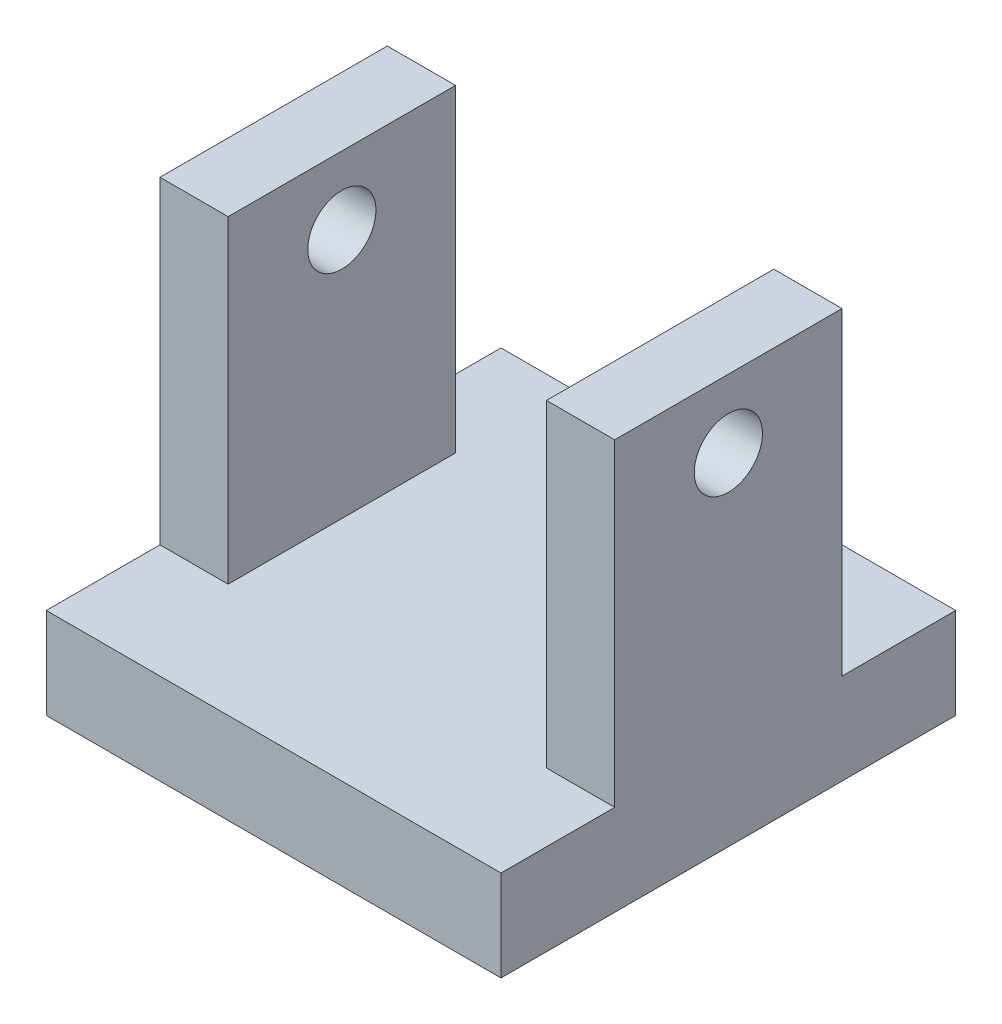
ISO-10303-21;
HEADER;
FILE_DESCRIPTION(('STEP AP214'),'2;1');
FILE_NAME('part.step','',(''),(''),'','','');
FILE_SCHEMA(('AUTOMOTIVE_DESIGN { 1 0 10303 214 1 1 1 1 }'));
ENDSEC;
DATA;
#1=APPLICATION_CONTEXT('core data for automotive mechanical design processes');
#2=APPLICATION_PROTOCOL_DEFINITION('international standard','automotive_design',2000,#1);
#3=PRODUCT_CONTEXT('',#1,'mechanical');
#4=PRODUCT('Part','Part','',(#3));
#5=PRODUCT_RELATED_PRODUCT_CATEGORY('part','',(#4));
#6=PRODUCT_DEFINITION_FORMATION('','',#4);
#7=PRODUCT_DEFINITION_CONTEXT('part definition',#1,'design');
#8=PRODUCT_DEFINITION('design','',#6,#7);
#9=PRODUCT_DEFINITION_SHAPE('','',#8);
#10=(LENGTH_UNIT() NAMED_UNIT(*) SI_UNIT(.MILLI.,.METRE.));
#11=(NAMED_UNIT(*) PLANE_ANGLE_UNIT() SI_UNIT($,.RADIAN.));
#12=(NAMED_UNIT(*) SI_UNIT($,.STERADIAN.) SOLID_ANGLE_UNIT());
#13=UNCERTAINTY_MEASURE_WITH_UNIT(LENGTH_MEASURE(1.E-05),#10,'distance_accuracy_value','');
#14=(GEOMETRIC_REPRESENTATION_CONTEXT(3) GLOBAL_UNCERTAINTY_ASSIGNED_CONTEXT((#13)) GLOBAL_UNIT_ASSIGNED_CONTEXT((#10,
#11,#12)) REPRESENTATION_CONTEXT('',''));
#15=CARTESIAN_POINT('',(0.,0.,0.));
#16=DIRECTION('',(0.,0.,1.));
#17=DIRECTION('',(1.,0.,0.));
#18=AXIS2_PLACEMENT_3D('',#15,#16,#17);
#19=CARTESIAN_POINT('',(0.,10.,0.));
#20=DIRECTION('',(0.,-1.,0.));
#21=DIRECTION('',(0.,0.,-1.));
#22=AXIS2_PLACEMENT_3D('',#19,#20,#21);
#23=PLANE('',#22);
#24=DIRECTION('',(-1.,0.,0.));
#25=VECTOR('',#24,1.);
#26=CARTESIAN_POINT('',(50.,10.,-37.5));
#27=LINE('',#26,#25);
#28=CARTESIAN_POINT('',(50.,10.,-37.5));
#29=VERTEX_POINT('',#28);
#30=CARTESIAN_POINT('',(42.5,10.,-37.5));
#31=VERTEX_POINT('',#30);
#32=EDGE_CURVE('E389',#29,#31,#27,.T.);
#33=ORIENTED_EDGE('',*,*,#32,.F.);
#34=DIRECTION('',(0.,0.,-1.));
#35=VECTOR('',#34,1.);
#36=CARTESIAN_POINT('',(50.,10.,0.));
#37=LINE('',#36,#35);
#38=CARTESIAN_POINT('',(50.,10.,-50.));
#39=VERTEX_POINT('',#38);
#40=EDGE_CURVE('E146',#29,#39,#37,.T.);
#41=ORIENTED_EDGE('',*,*,#40,.T.);
#42=DIRECTION('',(-1.,0.,0.));
#43=VECTOR('',#42,1.);
#44=CARTESIAN_POINT('',(0.,10.,-50.));
#45=LINE('',#44,#43);
#46=CARTESIAN_POINT('',(0.,10.,-50.));
#47=VERTEX_POINT('',#46);
#48=EDGE_CURVE('E190',#39,#47,#45,.T.);
#49=ORIENTED_EDGE('',*,*,#48,.T.);
#50=DIRECTION('',(0.,0.,1.));
#51=VECTOR('',#50,1.);
#52=CARTESIAN_POINT('',(0.,10.,0.));
#53=LINE('',#52,#51);
#54=CARTESIAN_POINT('',(0.,10.,-37.5));
#55=VERTEX_POINT('',#54);
#56=EDGE_CURVE('E183',#47,#55,#53,.T.);
#57=ORIENTED_EDGE('',*,*,#56,.T.);
#58=DIRECTION('',(-1.,0.,0.));
#59=VECTOR('',#58,1.);
#60=CARTESIAN_POINT('',(0.,10.,-37.5));
#61=LINE('',#60,#59);
#62=CARTESIAN_POINT('',(7.5,10.,-37.5));
#63=VERTEX_POINT('',#62);
#64=EDGE_CURVE('E160',#63,#55,#61,.T.);
#65=ORIENTED_EDGE('',*,*,#64,.F.);
#66=DIRECTION('',(0.,0.,-1.));
#67=VECTOR('',#66,1.);
#68=CARTESIAN_POINT('',(7.5,10.,-37.5));
#69=LINE('',#68,#67);
#70=CARTESIAN_POINT('',(7.5,10.,-12.5));
#71=VERTEX_POINT('',#70);
#72=EDGE_CURVE('E150',#71,#63,#69,.T.);
#73=ORIENTED_EDGE('',*,*,#72,.F.);
#74=DIRECTION('',(1.,0.,0.));
#75=VECTOR('',#74,1.);
#76=CARTESIAN_POINT('',(0.,10.,-12.5));
#77=LINE('',#76,#75);
#78=CARTESIAN_POINT('',(0.,10.,-12.5));
#79=VERTEX_POINT('',#78);
#80=EDGE_CURVE('E147',#79,#71,#77,.T.);
#81=ORIENTED_EDGE('',*,*,#80,.F.);
#82=CARTESIAN_POINT('',(0.,10.,0.));
#83=VERTEX_POINT('',#82);
#84=EDGE_CURVE('E186',#79,#83,#53,.T.);
#85=ORIENTED_EDGE('',*,*,#84,.T.);
#86=DIRECTION('',(1.,0.,0.));
#87=VECTOR('',#86,1.);
#88=CARTESIAN_POINT('',(0.,10.,0.));
#89=LINE('',#88,#87);
#90=CARTESIAN_POINT('',(50.,10.,0.));
#91=VERTEX_POINT('',#90);
#92=EDGE_CURVE('E185',#83,#91,#89,.T.);
#93=ORIENTED_EDGE('',*,*,#92,.T.);
#94=CARTESIAN_POINT('',(50.,10.,-12.5));
#95=VERTEX_POINT('',#94);
#96=EDGE_CURVE('E188',#91,#95,#37,.T.);
#97=ORIENTED_EDGE('',*,*,#96,.T.);
#98=DIRECTION('',(1.,0.,0.));
#99=VECTOR('',#98,1.);
#100=CARTESIAN_POINT('',(50.,10.,-12.5));
#101=LINE('',#100,#99);
#102=CARTESIAN_POINT('',(42.5,10.,-12.5));
#103=VERTEX_POINT('',#102);
#104=EDGE_CURVE('E56',#103,#95,#101,.T.);
#105=ORIENTED_EDGE('',*,*,#104,.F.);
#106=DIRECTION('',(0.,0.,1.));
#107=VECTOR('',#106,1.);
#108=CARTESIAN_POINT('',(42.5,10.,-37.5));
#109=LINE('',#108,#107);
#110=EDGE_CURVE('E51',#31,#103,#109,.T.);
#111=ORIENTED_EDGE('',*,*,#110,.F.);
#112=EDGE_LOOP('',(#33,#41,#49,#57,#65,#73,#81,#85,#93,#97,#105,#111));
#113=FACE_BOUND('',#112,.T.);
#114=ADVANCED_FACE('F35',(#113),#23,.F.);
#115=CARTESIAN_POINT('',(0.,10.,0.));
#116=DIRECTION('',(1.,0.,0.));
#117=DIRECTION('',(0.,0.,-1.));
#118=AXIS2_PLACEMENT_3D('',#115,#116,#117);
#119=PLANE('',#118);
#120=CARTESIAN_POINT('',(0.,37.5,-25.));
#121=DIRECTION('',(1.,0.,0.));
#122=DIRECTION('',(0.,0.,-1.));
#123=AXIS2_PLACEMENT_3D('',#120,#121,#122);
#124=CIRCLE('',#123,3.75);
#125=CARTESIAN_POINT('',(0.,37.5,-28.75));
#126=VERTEX_POINT('',#125);
#127=EDGE_CURVE('E385',#126,#126,#124,.F.);
#128=ORIENTED_EDGE('',*,*,#127,.F.);
#129=EDGE_LOOP('',(#128));
#130=FACE_BOUND('',#129,.T.);
#131=DIRECTION('',(0.,0.,1.));
#132=VECTOR('',#131,1.);
#133=CARTESIAN_POINT('',(0.,0.,0.));
#134=LINE('',#133,#132);
#135=CARTESIAN_POINT('',(0.,0.,-50.));
#136=VERTEX_POINT('',#135);
#137=CARTESIAN_POINT('',(0.,0.,0.));
#138=VERTEX_POINT('',#137);
#139=EDGE_CURVE('E182',#136,#138,#134,.T.);
#140=ORIENTED_EDGE('',*,*,#139,.T.);
#141=DIRECTION('',(0.,-1.,0.));
#142=VECTOR('',#141,1.);
#143=CARTESIAN_POINT('',(0.,10.,0.));
#144=LINE('',#143,#142);
#145=EDGE_CURVE('E11',#83,#138,#144,.T.);
#146=ORIENTED_EDGE('',*,*,#145,.F.);
#147=ORIENTED_EDGE('',*,*,#84,.F.);
#148=DIRECTION('',(0.,-1.,0.));
#149=VECTOR('',#148,1.);
#150=CARTESIAN_POINT('',(0.,45.,-12.5));
#151=LINE('',#150,#149);
#152=CARTESIAN_POINT('',(0.,45.,-12.5));
#153=VERTEX_POINT('',#152);
#154=EDGE_CURVE('E179',#153,#79,#151,.T.);
#155=ORIENTED_EDGE('',*,*,#154,.F.);
#156=DIRECTION('',(0.,0.,1.));
#157=VECTOR('',#156,1.);
#158=CARTESIAN_POINT('',(0.,45.,-37.5));
#159=LINE('',#158,#157);
#160=CARTESIAN_POINT('',(0.,45.,-37.5));
#161=VERTEX_POINT('',#160);
#162=EDGE_CURVE('E156',#161,#153,#159,.T.);
#163=ORIENTED_EDGE('',*,*,#162,.F.);
#164=DIRECTION('',(0.,-1.,0.));
#165=VECTOR('',#164,1.);
#166=CARTESIAN_POINT('',(0.,45.,-37.5));
#167=LINE('',#166,#165);
#168=EDGE_CURVE('E165',#161,#55,#167,.T.);
#169=ORIENTED_EDGE('',*,*,#168,.T.);
#170=ORIENTED_EDGE('',*,*,#56,.F.);
#171=DIRECTION('',(0.,-1.,0.));
#172=VECTOR('',#171,1.);
#173=CARTESIAN_POINT('',(0.,10.,-50.));
#174=LINE('',#173,#172);
#175=EDGE_CURVE('E192',#47,#136,#174,.T.);
#176=ORIENTED_EDGE('',*,*,#175,.T.);
#177=EDGE_LOOP('',(#140,#146,#147,#155,#163,#169,#170,#176));
#178=FACE_BOUND('',#177,.T.);
#179=ADVANCED_FACE('F37',(#130,#178),#119,.F.);
#180=CARTESIAN_POINT('',(0.,10.,0.));
#181=DIRECTION('',(0.,0.,-1.));
#182=DIRECTION('',(-1.,0.,0.));
#183=AXIS2_PLACEMENT_3D('',#180,#181,#182);
#184=PLANE('',#183);
#185=DIRECTION('',(1.,0.,0.));
#186=VECTOR('',#185,1.);
#187=CARTESIAN_POINT('',(0.,0.,0.));
#188=LINE('',#187,#186);
#189=CARTESIAN_POINT('',(50.,0.,0.));
#190=VERTEX_POINT('',#189);
#191=EDGE_CURVE('E195',#138,#190,#188,.T.);
#192=ORIENTED_EDGE('',*,*,#191,.T.);
#193=DIRECTION('',(0.,-1.,0.));
#194=VECTOR('',#193,1.);
#195=CARTESIAN_POINT('',(50.,10.,0.));
#196=LINE('',#195,#194);
#197=EDGE_CURVE('E44',#91,#190,#196,.T.);
#198=ORIENTED_EDGE('',*,*,#197,.F.);
#199=ORIENTED_EDGE('',*,*,#92,.F.);
#200=ORIENTED_EDGE('',*,*,#145,.T.);
#201=EDGE_LOOP('',(#192,#198,#199,#200));
#202=FACE_BOUND('',#201,.T.);
#203=ADVANCED_FACE('F237',(#202),#184,.F.);
#204=CARTESIAN_POINT('',(50.,10.,0.));
#205=DIRECTION('',(-1.,0.,0.));
#206=DIRECTION('',(0.,0.,1.));
#207=AXIS2_PLACEMENT_3D('',#204,#205,#206);
#208=PLANE('',#207);
#209=CARTESIAN_POINT('',(50.,37.5,-25.));
#210=DIRECTION('',(1.,0.,0.));
#211=DIRECTION('',(0.,0.,-1.));
#212=AXIS2_PLACEMENT_3D('',#209,#210,#211);
#213=CIRCLE('',#212,3.75);
#214=CARTESIAN_POINT('',(50.,37.5,-28.75));
#215=VERTEX_POINT('',#214);
#216=EDGE_CURVE('E404',#215,#215,#213,.T.);
#217=ORIENTED_EDGE('',*,*,#216,.F.);
#218=EDGE_LOOP('',(#217));
#219=FACE_BOUND('',#218,.T.);
#220=DIRECTION('',(0.,0.,-1.));
#221=VECTOR('',#220,1.);
#222=CARTESIAN_POINT('',(50.,0.,0.));
#223=LINE('',#222,#221);
#224=CARTESIAN_POINT('',(50.,0.,-50.));
#225=VERTEX_POINT('',#224);
#226=EDGE_CURVE('E197',#190,#225,#223,.T.);
#227=ORIENTED_EDGE('',*,*,#226,.T.);
#228=DIRECTION('',(0.,-1.,0.));
#229=VECTOR('',#228,1.);
#230=CARTESIAN_POINT('',(50.,10.,-50.));
#231=LINE('',#230,#229);
#232=EDGE_CURVE('E203',#39,#225,#231,.T.);
#233=ORIENTED_EDGE('',*,*,#232,.F.);
#234=ORIENTED_EDGE('',*,*,#40,.F.);
#235=DIRECTION('',(0.,-1.,0.));
#236=VECTOR('',#235,1.);
#237=CARTESIAN_POINT('',(50.,45.,-37.5));
#238=LINE('',#237,#236);
#239=CARTESIAN_POINT('',(50.,45.,-37.5));
#240=VERTEX_POINT('',#239);
#241=EDGE_CURVE('E128',#240,#29,#238,.T.);
#242=ORIENTED_EDGE('',*,*,#241,.F.);
#243=DIRECTION('',(0.,0.,-1.));
#244=VECTOR('',#243,1.);
#245=CARTESIAN_POINT('',(50.,45.,-37.5));
#246=LINE('',#245,#244);
#247=CARTESIAN_POINT('',(50.,45.,-12.5));
#248=VERTEX_POINT('',#247);
#249=EDGE_CURVE('E134',#248,#240,#246,.T.);
#250=ORIENTED_EDGE('',*,*,#249,.F.);
#251=DIRECTION('',(0.,-1.,0.));
#252=VECTOR('',#251,1.);
#253=CARTESIAN_POINT('',(50.,45.,-12.5));
#254=LINE('',#253,#252);
#255=EDGE_CURVE('E397',#248,#95,#254,.T.);
#256=ORIENTED_EDGE('',*,*,#255,.T.);
#257=ORIENTED_EDGE('',*,*,#96,.F.);
#258=ORIENTED_EDGE('',*,*,#197,.T.);
#259=EDGE_LOOP('',(#227,#233,#234,#242,#250,#256,#257,#258));
#260=FACE_BOUND('',#259,.T.);
#261=ADVANCED_FACE('F144',(#219,#260),#208,.F.);
#262=CARTESIAN_POINT('',(0.,10.,-50.));
#263=DIRECTION('',(0.,0.,1.));
#264=DIRECTION('',(1.,0.,0.));
#265=AXIS2_PLACEMENT_3D('',#262,#263,#264);
#266=PLANE('',#265);
#267=DIRECTION('',(-1.,0.,0.));
#268=VECTOR('',#267,1.);
#269=CARTESIAN_POINT('',(0.,0.,-50.));
#270=LINE('',#269,#268);
#271=EDGE_CURVE('E199',#225,#136,#270,.T.);
#272=ORIENTED_EDGE('',*,*,#271,.T.);
#273=ORIENTED_EDGE('',*,*,#175,.F.);
#274=ORIENTED_EDGE('',*,*,#48,.F.);
#275=ORIENTED_EDGE('',*,*,#232,.T.);
#276=EDGE_LOOP('',(#272,#273,#274,#275));
#277=FACE_BOUND('',#276,.T.);
#278=ADVANCED_FACE('F218',(#277),#266,.F.);
#279=CARTESIAN_POINT('',(0.,0.,0.));
#280=DIRECTION('',(0.,-1.,0.));
#281=DIRECTION('',(0.,0.,-1.));
#282=AXIS2_PLACEMENT_3D('',#279,#280,#281);
#283=PLANE('',#282);
#284=ORIENTED_EDGE('',*,*,#139,.F.);
#285=ORIENTED_EDGE('',*,*,#271,.F.);
#286=ORIENTED_EDGE('',*,*,#226,.F.);
#287=ORIENTED_EDGE('',*,*,#191,.F.);
#288=EDGE_LOOP('',(#284,#285,#286,#287));
#289=FACE_BOUND('',#288,.T.);
#290=ADVANCED_FACE('F215',(#289),#283,.T.);
#291=CARTESIAN_POINT('',(0.,45.,-12.5));
#292=DIRECTION('',(0.,0.,-1.));
#293=DIRECTION('',(-1.,0.,0.));
#294=AXIS2_PLACEMENT_3D('',#291,#292,#293);
#295=PLANE('',#294);
#296=ORIENTED_EDGE('',*,*,#80,.T.);
#297=DIRECTION('',(0.,-1.,0.));
#298=VECTOR('',#297,1.);
#299=CARTESIAN_POINT('',(7.5,45.,-12.5));
#300=LINE('',#299,#298);
#301=CARTESIAN_POINT('',(7.5,45.,-12.5));
#302=VERTEX_POINT('',#301);
#303=EDGE_CURVE('E176',#302,#71,#300,.T.);
#304=ORIENTED_EDGE('',*,*,#303,.F.);
#305=DIRECTION('',(1.,0.,0.));
#306=VECTOR('',#305,1.);
#307=CARTESIAN_POINT('',(0.,45.,-12.5));
#308=LINE('',#307,#306);
#309=EDGE_CURVE('E159',#153,#302,#308,.T.);
#310=ORIENTED_EDGE('',*,*,#309,.F.);
#311=ORIENTED_EDGE('',*,*,#154,.T.);
#312=EDGE_LOOP('',(#296,#304,#310,#311));
#313=FACE_BOUND('',#312,.T.);
#314=ADVANCED_FACE('F235',(#313),#295,.F.);
#315=CARTESIAN_POINT('',(7.5,45.,-37.5));
#316=DIRECTION('',(-1.,0.,0.));
#317=DIRECTION('',(0.,0.,1.));
#318=AXIS2_PLACEMENT_3D('',#315,#316,#317);
#319=PLANE('',#318);
#320=CARTESIAN_POINT('',(7.5,37.5,-25.));
#321=DIRECTION('',(-1.,0.,0.));
#322=DIRECTION('',(0.,0.,1.));
#323=AXIS2_PLACEMENT_3D('',#320,#321,#322);
#324=CIRCLE('',#323,3.75);
#325=CARTESIAN_POINT('',(7.5,37.5,-21.25));
#326=VERTEX_POINT('',#325);
#327=EDGE_CURVE('E388',#326,#326,#324,.T.);
#328=ORIENTED_EDGE('',*,*,#327,.T.);
#329=EDGE_LOOP('',(#328));
#330=FACE_BOUND('',#329,.T.);
#331=ORIENTED_EDGE('',*,*,#72,.T.);
#332=DIRECTION('',(0.,-1.,0.));
#333=VECTOR('',#332,1.);
#334=CARTESIAN_POINT('',(7.5,45.,-37.5));
#335=LINE('',#334,#333);
#336=CARTESIAN_POINT('',(7.5,45.,-37.5));
#337=VERTEX_POINT('',#336);
#338=EDGE_CURVE('E173',#337,#63,#335,.T.);
#339=ORIENTED_EDGE('',*,*,#338,.F.);
#340=DIRECTION('',(0.,0.,-1.));
#341=VECTOR('',#340,1.);
#342=CARTESIAN_POINT('',(7.5,45.,-37.5));
#343=LINE('',#342,#341);
#344=EDGE_CURVE('E162',#302,#337,#343,.T.);
#345=ORIENTED_EDGE('',*,*,#344,.F.);
#346=ORIENTED_EDGE('',*,*,#303,.T.);
#347=EDGE_LOOP('',(#331,#339,#345,#346));
#348=FACE_BOUND('',#347,.T.);
#349=ADVANCED_FACE('F231',(#330,#348),#319,.F.);
#350=CARTESIAN_POINT('',(0.,45.,-37.5));
#351=DIRECTION('',(0.,0.,1.));
#352=DIRECTION('',(1.,0.,0.));
#353=AXIS2_PLACEMENT_3D('',#350,#351,#352);
#354=PLANE('',#353);
#355=ORIENTED_EDGE('',*,*,#64,.T.);
#356=ORIENTED_EDGE('',*,*,#168,.F.);
#357=DIRECTION('',(-1.,0.,0.));
#358=VECTOR('',#357,1.);
#359=CARTESIAN_POINT('',(0.,45.,-37.5));
#360=LINE('',#359,#358);
#361=EDGE_CURVE('E164',#337,#161,#360,.T.);
#362=ORIENTED_EDGE('',*,*,#361,.F.);
#363=ORIENTED_EDGE('',*,*,#338,.T.);
#364=EDGE_LOOP('',(#355,#356,#362,#363));
#365=FACE_BOUND('',#364,.T.);
#366=ADVANCED_FACE('F226',(#365),#354,.F.);
#367=CARTESIAN_POINT('',(0.,45.,0.));
#368=DIRECTION('',(0.,1.,0.));
#369=DIRECTION('',(0.,0.,1.));
#370=AXIS2_PLACEMENT_3D('',#367,#368,#369);
#371=PLANE('',#370);
#372=ORIENTED_EDGE('',*,*,#162,.T.);
#373=ORIENTED_EDGE('',*,*,#309,.T.);
#374=ORIENTED_EDGE('',*,*,#344,.T.);
#375=ORIENTED_EDGE('',*,*,#361,.T.);
#376=EDGE_LOOP('',(#372,#373,#374,#375));
#377=FACE_BOUND('',#376,.T.);
#378=ADVANCED_FACE('F282',(#377),#371,.T.);
#379=CARTESIAN_POINT('',(50.,45.,-37.5));
#380=DIRECTION('',(0.,0.,1.));
#381=DIRECTION('',(1.,0.,0.));
#382=AXIS2_PLACEMENT_3D('',#379,#380,#381);
#383=PLANE('',#382);
#384=ORIENTED_EDGE('',*,*,#32,.T.);
#385=DIRECTION('',(0.,-1.,0.));
#386=VECTOR('',#385,1.);
#387=CARTESIAN_POINT('',(42.5,45.,-37.5));
#388=LINE('',#387,#386);
#389=CARTESIAN_POINT('',(42.5,45.,-37.5));
#390=VERTEX_POINT('',#389);
#391=EDGE_CURVE('E130',#390,#31,#388,.T.);
#392=ORIENTED_EDGE('',*,*,#391,.F.);
#393=DIRECTION('',(-1.,0.,0.));
#394=VECTOR('',#393,1.);
#395=CARTESIAN_POINT('',(50.,45.,-37.5));
#396=LINE('',#395,#394);
#397=EDGE_CURVE('E124',#240,#390,#396,.T.);
#398=ORIENTED_EDGE('',*,*,#397,.F.);
#399=ORIENTED_EDGE('',*,*,#241,.T.);
#400=EDGE_LOOP('',(#384,#392,#398,#399));
#401=FACE_BOUND('',#400,.T.);
#402=ADVANCED_FACE('F126',(#401),#383,.F.);
#403=CARTESIAN_POINT('',(42.5,45.,-37.5));
#404=DIRECTION('',(1.,0.,0.));
#405=DIRECTION('',(0.,0.,-1.));
#406=AXIS2_PLACEMENT_3D('',#403,#404,#405);
#407=PLANE('',#406);
#408=CARTESIAN_POINT('',(42.5,37.5,-25.));
#409=DIRECTION('',(1.,0.,0.));
#410=DIRECTION('',(0.,0.,-1.));
#411=AXIS2_PLACEMENT_3D('',#408,#409,#410);
#412=CIRCLE('',#411,3.75);
#413=CARTESIAN_POINT('',(42.5,37.5,-28.75));
#414=VERTEX_POINT('',#413);
#415=EDGE_CURVE('E39',#414,#414,#412,.T.);
#416=ORIENTED_EDGE('',*,*,#415,.T.);
#417=EDGE_LOOP('',(#416));
#418=FACE_BOUND('',#417,.T.);
#419=ORIENTED_EDGE('',*,*,#110,.T.);
#420=DIRECTION('',(0.,-1.,0.));
#421=VECTOR('',#420,1.);
#422=CARTESIAN_POINT('',(42.5,45.,-12.5));
#423=LINE('',#422,#421);
#424=CARTESIAN_POINT('',(42.5,45.,-12.5));
#425=VERTEX_POINT('',#424);
#426=EDGE_CURVE('E152',#425,#103,#423,.T.);
#427=ORIENTED_EDGE('',*,*,#426,.F.);
#428=DIRECTION('',(0.,0.,1.));
#429=VECTOR('',#428,1.);
#430=CARTESIAN_POINT('',(42.5,45.,-37.5));
#431=LINE('',#430,#429);
#432=EDGE_CURVE('E133',#390,#425,#431,.T.);
#433=ORIENTED_EDGE('',*,*,#432,.F.);
#434=ORIENTED_EDGE('',*,*,#391,.T.);
#435=EDGE_LOOP('',(#419,#427,#433,#434));
#436=FACE_BOUND('',#435,.T.);
#437=ADVANCED_FACE('F296',(#418,#436),#407,.F.);
#438=CARTESIAN_POINT('',(50.,45.,-12.5));
#439=DIRECTION('',(0.,0.,-1.));
#440=DIRECTION('',(-1.,0.,0.));
#441=AXIS2_PLACEMENT_3D('',#438,#439,#440);
#442=PLANE('',#441);
#443=ORIENTED_EDGE('',*,*,#104,.T.);
#444=ORIENTED_EDGE('',*,*,#255,.F.);
#445=DIRECTION('',(1.,0.,0.));
#446=VECTOR('',#445,1.);
#447=CARTESIAN_POINT('',(50.,45.,-12.5));
#448=LINE('',#447,#446);
#449=EDGE_CURVE('E139',#425,#248,#448,.T.);
#450=ORIENTED_EDGE('',*,*,#449,.F.);
#451=ORIENTED_EDGE('',*,*,#426,.T.);
#452=EDGE_LOOP('',(#443,#444,#450,#451));
#453=FACE_BOUND('',#452,.T.);
#454=ADVANCED_FACE('F303',(#453),#442,.F.);
#455=CARTESIAN_POINT('',(0.,45.,0.));
#456=DIRECTION('',(0.,-1.,0.));
#457=DIRECTION('',(0.,0.,-1.));
#458=AXIS2_PLACEMENT_3D('',#455,#456,#457);
#459=PLANE('',#458);
#460=ORIENTED_EDGE('',*,*,#249,.T.);
#461=ORIENTED_EDGE('',*,*,#397,.T.);
#462=ORIENTED_EDGE('',*,*,#432,.T.);
#463=ORIENTED_EDGE('',*,*,#449,.T.);
#464=EDGE_LOOP('',(#460,#461,#462,#463));
#465=FACE_BOUND('',#464,.T.);
#466=ADVANCED_FACE('F137',(#465),#459,.F.);
#467=CARTESIAN_POINT('',(-10.6066017177982,37.5,-25.));
#468=DIRECTION('',(1.,0.,0.));
#469=DIRECTION('',(0.,0.,-1.));
#470=AXIS2_PLACEMENT_3D('',#467,#468,#469);
#471=CYLINDRICAL_SURFACE('',#470,3.75);
#472=ORIENTED_EDGE('',*,*,#216,.T.);
#473=EDGE_LOOP('',(#472));
#474=FACE_BOUND('',#473,.T.);
#475=ORIENTED_EDGE('',*,*,#415,.F.);
#476=EDGE_LOOP('',(#475));
#477=FACE_BOUND('',#476,.T.);
#478=ADVANCED_FACE('F318',(#474,#477),#471,.F.);
#479=ORIENTED_EDGE('',*,*,#127,.T.);
#480=EDGE_LOOP('',(#479));
#481=FACE_BOUND('',#480,.T.);
#482=ORIENTED_EDGE('',*,*,#327,.F.);
#483=EDGE_LOOP('',(#482));
#484=FACE_BOUND('',#483,.T.);
#485=ADVANCED_FACE('F325',(#481,#484),#471,.F.);
#486=CLOSED_SHELL('',(#114,#179,#203,#261,#278,#290,#314,#349,#366,#378,#402,#437,#454,#466,
#478,#485));
#487=MANIFOLD_SOLID_BREP('B2',#486);
#488=ADVANCED_BREP_SHAPE_REPRESENTATION('',(#18,#487),#14);
#489=SHAPE_DEFINITION_REPRESENTATION(#9,#488);
ENDSEC;
END-ISO-10303-21;
